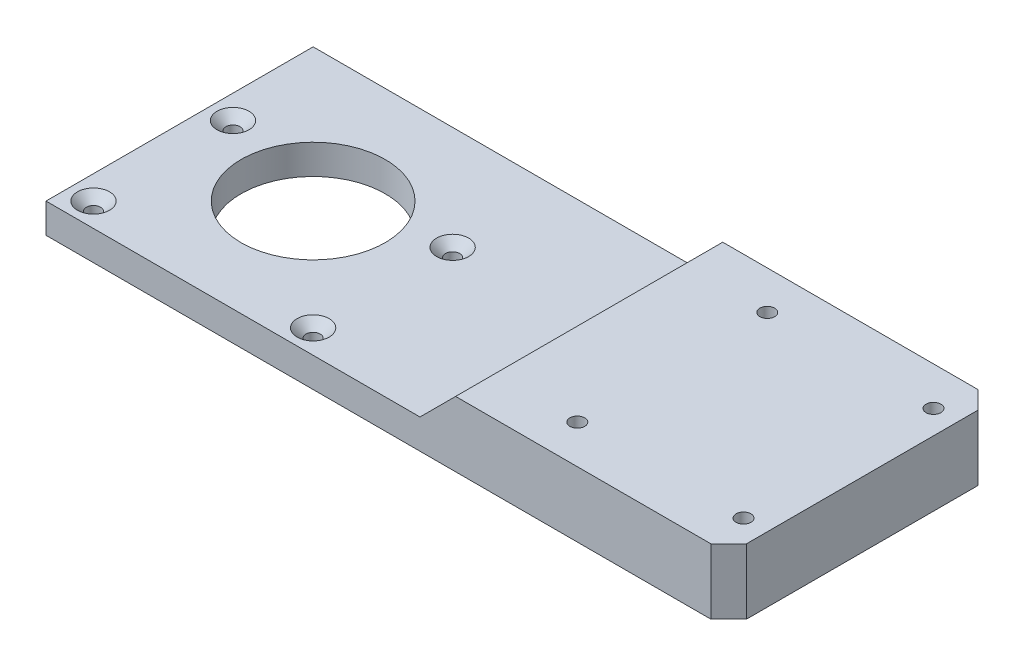
ISO-10303-21;
HEADER;
FILE_DESCRIPTION(('STEP AP214'),'2;1');
FILE_NAME('part.step','',(''),(''),'','','');
FILE_SCHEMA(('AUTOMOTIVE_DESIGN { 1 0 10303 214 1 1 1 1 }'));
ENDSEC;
DATA;
#1=APPLICATION_CONTEXT('core data for automotive mechanical design processes');
#2=APPLICATION_PROTOCOL_DEFINITION('international standard','automotive_design',2000,#1);
#3=PRODUCT_CONTEXT('',#1,'mechanical');
#4=PRODUCT('Part','Part','',(#3));
#5=PRODUCT_RELATED_PRODUCT_CATEGORY('part','',(#4));
#6=PRODUCT_DEFINITION_FORMATION('','',#4);
#7=PRODUCT_DEFINITION_CONTEXT('part definition',#1,'design');
#8=PRODUCT_DEFINITION('design','',#6,#7);
#9=PRODUCT_DEFINITION_SHAPE('','',#8);
#10=(LENGTH_UNIT() NAMED_UNIT(*) SI_UNIT(.MILLI.,.METRE.));
#11=(NAMED_UNIT(*) PLANE_ANGLE_UNIT() SI_UNIT($,.RADIAN.));
#12=(NAMED_UNIT(*) SI_UNIT($,.STERADIAN.) SOLID_ANGLE_UNIT());
#13=UNCERTAINTY_MEASURE_WITH_UNIT(LENGTH_MEASURE(1.E-05),#10,'distance_accuracy_value','');
#14=(GEOMETRIC_REPRESENTATION_CONTEXT(3) GLOBAL_UNCERTAINTY_ASSIGNED_CONTEXT((#13)) GLOBAL_UNIT_ASSIGNED_CONTEXT((#10,
#11,#12)) REPRESENTATION_CONTEXT('',''));
#15=CARTESIAN_POINT('',(0.,0.,0.));
#16=DIRECTION('',(0.,0.,1.));
#17=DIRECTION('',(1.,0.,0.));
#18=AXIS2_PLACEMENT_3D('',#15,#16,#17);
#19=CARTESIAN_POINT('',(0.,11.,0.));
#20=DIRECTION('',(0.,-1.,0.));
#21=DIRECTION('',(0.,0.,-1.));
#22=AXIS2_PLACEMENT_3D('',#19,#20,#21);
#23=PLANE('',#22);
#24=CARTESIAN_POINT('',(83.,11.,-16.));
#25=DIRECTION('',(0.,1.,0.));
#26=DIRECTION('',(0.,0.,1.));
#27=AXIS2_PLACEMENT_3D('',#24,#25,#26);
#28=CIRCLE('',#27,1.24999999999999);
#29=CARTESIAN_POINT('',(83.,11.,-14.75));
#30=VERTEX_POINT('',#29);
#31=EDGE_CURVE('E357',#30,#30,#28,.T.);
#32=ORIENTED_EDGE('',*,*,#31,.F.);
#33=EDGE_LOOP('',(#32));
#34=FACE_BOUND('',#33,.T.);
#35=CARTESIAN_POINT('',(111.,11.,-16.));
#36=DIRECTION('',(0.,1.,0.));
#37=DIRECTION('',(0.,0.,1.));
#38=AXIS2_PLACEMENT_3D('',#35,#36,#37);
#39=CIRCLE('',#38,1.24999999999999);
#40=CARTESIAN_POINT('',(111.,11.,-14.75));
#41=VERTEX_POINT('',#40);
#42=EDGE_CURVE('E353',#41,#41,#39,.T.);
#43=ORIENTED_EDGE('',*,*,#42,.F.);
#44=EDGE_LOOP('',(#43));
#45=FACE_BOUND('',#44,.T.);
#46=CARTESIAN_POINT('',(83.,11.,16.));
#47=DIRECTION('',(0.,1.,0.));
#48=DIRECTION('',(0.,0.,1.));
#49=AXIS2_PLACEMENT_3D('',#46,#47,#48);
#50=CIRCLE('',#49,1.24999999999999);
#51=CARTESIAN_POINT('',(83.,11.,17.25));
#52=VERTEX_POINT('',#51);
#53=EDGE_CURVE('E347',#52,#52,#50,.T.);
#54=ORIENTED_EDGE('',*,*,#53,.F.);
#55=EDGE_LOOP('',(#54));
#56=FACE_BOUND('',#55,.T.);
#57=DIRECTION('',(0.,0.,-1.));
#58=VECTOR('',#57,1.);
#59=CARTESIAN_POINT('',(115.,11.,-22.5));
#60=LINE('',#59,#58);
#61=CARTESIAN_POINT('',(115.,11.,19.5));
#62=VERTEX_POINT('',#61);
#63=CARTESIAN_POINT('',(115.,11.,-19.5));
#64=VERTEX_POINT('',#63);
#65=EDGE_CURVE('E131',#62,#64,#60,.T.);
#66=ORIENTED_EDGE('',*,*,#65,.T.);
#67=DIRECTION('',(-0.707106781186546,0.,-0.707106781186549));
#68=VECTOR('',#67,1.);
#69=CARTESIAN_POINT('',(112.,11.,-22.5));
#70=LINE('',#69,#68);
#71=CARTESIAN_POINT('',(112.,11.,-22.5));
#72=VERTEX_POINT('',#71);
#73=EDGE_CURVE('E47',#64,#72,#70,.T.);
#74=ORIENTED_EDGE('',*,*,#73,.T.);
#75=DIRECTION('',(-1.,0.,0.));
#76=VECTOR('',#75,1.);
#77=CARTESIAN_POINT('',(115.,11.,-22.5));
#78=LINE('',#77,#76);
#79=CARTESIAN_POINT('',(69.,11.,-22.5));
#80=VERTEX_POINT('',#79);
#81=EDGE_CURVE('E134',#72,#80,#78,.T.);
#82=ORIENTED_EDGE('',*,*,#81,.T.);
#83=DIRECTION('',(0.,0.,1.));
#84=VECTOR('',#83,1.);
#85=CARTESIAN_POINT('',(69.,11.,0.));
#86=LINE('',#85,#84);
#87=CARTESIAN_POINT('',(69.,11.,22.5));
#88=VERTEX_POINT('',#87);
#89=EDGE_CURVE('E115',#80,#88,#86,.T.);
#90=ORIENTED_EDGE('',*,*,#89,.T.);
#91=DIRECTION('',(1.,0.,0.));
#92=VECTOR('',#91,1.);
#93=CARTESIAN_POINT('',(115.,11.,22.5));
#94=LINE('',#93,#92);
#95=CARTESIAN_POINT('',(112.,11.,22.5));
#96=VERTEX_POINT('',#95);
#97=EDGE_CURVE('E109',#88,#96,#94,.T.);
#98=ORIENTED_EDGE('',*,*,#97,.T.);
#99=DIRECTION('',(-0.707106781186549,0.,0.707106781186546));
#100=VECTOR('',#99,1.);
#101=CARTESIAN_POINT('',(115.,11.,19.5));
#102=LINE('',#101,#100);
#103=EDGE_CURVE('E212',#96,#62,#102,.F.);
#104=ORIENTED_EDGE('',*,*,#103,.T.);
#105=EDGE_LOOP('',(#66,#74,#82,#90,#98,#104));
#106=FACE_BOUND('',#105,.T.);
#107=CARTESIAN_POINT('',(111.,11.,16.));
#108=DIRECTION('',(0.,1.,0.));
#109=DIRECTION('',(0.,0.,1.));
#110=AXIS2_PLACEMENT_3D('',#107,#108,#109);
#111=CIRCLE('',#110,1.24999999999999);
#112=CARTESIAN_POINT('',(111.,11.,17.25));
#113=VERTEX_POINT('',#112);
#114=EDGE_CURVE('E137',#113,#113,#111,.T.);
#115=ORIENTED_EDGE('',*,*,#114,.F.);
#116=EDGE_LOOP('',(#115));
#117=FACE_BOUND('',#116,.T.);
#118=ADVANCED_FACE('F39',(#34,#45,#56,#106,#117),#23,.F.);
#119=CARTESIAN_POINT('',(0.,5.,22.5));
#120=DIRECTION('',(0.,0.,-1.));
#121=DIRECTION('',(-1.,0.,0.));
#122=AXIS2_PLACEMENT_3D('',#119,#120,#121);
#123=PLANE('',#122);
#124=DIRECTION('',(1.,0.,0.));
#125=VECTOR('',#124,1.);
#126=CARTESIAN_POINT('',(0.,0.,22.5));
#127=LINE('',#126,#125);
#128=CARTESIAN_POINT('',(0.,0.,22.5));
#129=VERTEX_POINT('',#128);
#130=CARTESIAN_POINT('',(112.,0.,22.5));
#131=VERTEX_POINT('',#130);
#132=EDGE_CURVE('E183',#129,#131,#127,.T.);
#133=ORIENTED_EDGE('',*,*,#132,.T.);
#134=DIRECTION('',(0.,1.,0.));
#135=VECTOR('',#134,1.);
#136=CARTESIAN_POINT('',(112.,5.,22.5));
#137=LINE('',#136,#135);
#138=EDGE_CURVE('E11',#131,#96,#137,.T.);
#139=ORIENTED_EDGE('',*,*,#138,.T.);
#140=ORIENTED_EDGE('',*,*,#97,.F.);
#141=DIRECTION('',(0.707106781186546,0.707106781186549,0.));
#142=VECTOR('',#141,1.);
#143=CARTESIAN_POINT('',(69.,11.,22.5));
#144=LINE('',#143,#142);
#145=CARTESIAN_POINT('',(63.,5.,22.5));
#146=VERTEX_POINT('',#145);
#147=EDGE_CURVE('E104',#88,#146,#144,.F.);
#148=ORIENTED_EDGE('',*,*,#147,.T.);
#149=DIRECTION('',(1.,0.,0.));
#150=VECTOR('',#149,1.);
#151=CARTESIAN_POINT('',(0.,5.,22.5));
#152=LINE('',#151,#150);
#153=CARTESIAN_POINT('',(0.,5.,22.5));
#154=VERTEX_POINT('',#153);
#155=EDGE_CURVE('E107',#154,#146,#152,.T.);
#156=ORIENTED_EDGE('',*,*,#155,.F.);
#157=DIRECTION('',(0.,-1.,0.));
#158=VECTOR('',#157,1.);
#159=CARTESIAN_POINT('',(0.,5.,22.5));
#160=LINE('',#159,#158);
#161=EDGE_CURVE('E187',#154,#129,#160,.T.);
#162=ORIENTED_EDGE('',*,*,#161,.T.);
#163=EDGE_LOOP('',(#133,#139,#140,#148,#156,#162));
#164=FACE_BOUND('',#163,.T.);
#165=ADVANCED_FACE('F106',(#164),#123,.F.);
#166=CARTESIAN_POINT('',(115.,5.,22.5));
#167=DIRECTION('',(-1.,0.,0.));
#168=DIRECTION('',(0.,0.,1.));
#169=AXIS2_PLACEMENT_3D('',#166,#167,#168);
#170=PLANE('',#169);
#171=DIRECTION('',(0.,0.,-1.));
#172=VECTOR('',#171,1.);
#173=CARTESIAN_POINT('',(115.,0.,22.5));
#174=LINE('',#173,#172);
#175=CARTESIAN_POINT('',(115.,0.,19.5));
#176=VERTEX_POINT('',#175);
#177=CARTESIAN_POINT('',(115.,0.,-19.5));
#178=VERTEX_POINT('',#177);
#179=EDGE_CURVE('E189',#176,#178,#174,.T.);
#180=ORIENTED_EDGE('',*,*,#179,.T.);
#181=DIRECTION('',(0.,1.,0.));
#182=VECTOR('',#181,1.);
#183=CARTESIAN_POINT('',(115.,11.,-19.5));
#184=LINE('',#183,#182);
#185=EDGE_CURVE('E60',#178,#64,#184,.T.);
#186=ORIENTED_EDGE('',*,*,#185,.T.);
#187=ORIENTED_EDGE('',*,*,#65,.F.);
#188=DIRECTION('',(0.,-1.,0.));
#189=VECTOR('',#188,1.);
#190=CARTESIAN_POINT('',(115.,5.,19.5));
#191=LINE('',#190,#189);
#192=EDGE_CURVE('E208',#62,#176,#191,.T.);
#193=ORIENTED_EDGE('',*,*,#192,.T.);
#194=EDGE_LOOP('',(#180,#186,#187,#193));
#195=FACE_BOUND('',#194,.T.);
#196=ADVANCED_FACE('F226',(#195),#170,.F.);
#197=CARTESIAN_POINT('',(0.,5.,-22.5));
#198=DIRECTION('',(0.,0.,-1.));
#199=DIRECTION('',(-1.,0.,0.));
#200=AXIS2_PLACEMENT_3D('',#197,#198,#199);
#201=PLANE('',#200);
#202=ORIENTED_EDGE('',*,*,#81,.F.);
#203=DIRECTION('',(0.,-1.,0.));
#204=VECTOR('',#203,1.);
#205=CARTESIAN_POINT('',(112.,0.,-22.5));
#206=LINE('',#205,#204);
#207=CARTESIAN_POINT('',(112.,0.,-22.5));
#208=VERTEX_POINT('',#207);
#209=EDGE_CURVE('E201',#72,#208,#206,.T.);
#210=ORIENTED_EDGE('',*,*,#209,.T.);
#211=DIRECTION('',(1.,0.,0.));
#212=VECTOR('',#211,1.);
#213=CARTESIAN_POINT('',(0.,0.,-22.5));
#214=LINE('',#213,#212);
#215=CARTESIAN_POINT('',(0.,0.,-22.5));
#216=VERTEX_POINT('',#215);
#217=EDGE_CURVE('E191',#216,#208,#214,.T.);
#218=ORIENTED_EDGE('',*,*,#217,.F.);
#219=DIRECTION('',(0.,-1.,0.));
#220=VECTOR('',#219,1.);
#221=CARTESIAN_POINT('',(0.,5.,-22.5));
#222=LINE('',#221,#220);
#223=CARTESIAN_POINT('',(0.,5.,-22.5));
#224=VERTEX_POINT('',#223);
#225=EDGE_CURVE('E197',#224,#216,#222,.T.);
#226=ORIENTED_EDGE('',*,*,#225,.F.);
#227=DIRECTION('',(1.,0.,0.));
#228=VECTOR('',#227,1.);
#229=CARTESIAN_POINT('',(0.,5.,-22.5));
#230=LINE('',#229,#228);
#231=CARTESIAN_POINT('',(63.,5.,-22.5));
#232=VERTEX_POINT('',#231);
#233=EDGE_CURVE('E125',#224,#232,#230,.T.);
#234=ORIENTED_EDGE('',*,*,#233,.T.);
#235=DIRECTION('',(-0.707106781186546,-0.707106781186549,0.));
#236=VECTOR('',#235,1.);
#237=CARTESIAN_POINT('',(31.5000000000002,-26.5,-22.5));
#238=LINE('',#237,#236);
#239=EDGE_CURVE('E114',#232,#80,#238,.F.);
#240=ORIENTED_EDGE('',*,*,#239,.T.);
#241=EDGE_LOOP('',(#202,#210,#218,#226,#234,#240));
#242=FACE_BOUND('',#241,.T.);
#243=ADVANCED_FACE('F220',(#242),#201,.T.);
#244=CARTESIAN_POINT('',(0.,5.,22.5));
#245=DIRECTION('',(-1.,0.,0.));
#246=DIRECTION('',(0.,0.,1.));
#247=AXIS2_PLACEMENT_3D('',#244,#245,#246);
#248=PLANE('',#247);
#249=DIRECTION('',(0.,0.,-1.));
#250=VECTOR('',#249,1.);
#251=CARTESIAN_POINT('',(0.,0.,22.5));
#252=LINE('',#251,#250);
#253=EDGE_CURVE('E126',#129,#216,#252,.T.);
#254=ORIENTED_EDGE('',*,*,#253,.F.);
#255=ORIENTED_EDGE('',*,*,#161,.F.);
#256=DIRECTION('',(0.,0.,-1.));
#257=VECTOR('',#256,1.);
#258=CARTESIAN_POINT('',(0.,5.,22.5));
#259=LINE('',#258,#257);
#260=EDGE_CURVE('E124',#154,#224,#259,.T.);
#261=ORIENTED_EDGE('',*,*,#260,.T.);
#262=ORIENTED_EDGE('',*,*,#225,.T.);
#263=EDGE_LOOP('',(#254,#255,#261,#262));
#264=FACE_BOUND('',#263,.T.);
#265=ADVANCED_FACE('F233',(#264),#248,.T.);
#266=CARTESIAN_POINT('',(0.,5.,0.));
#267=DIRECTION('',(0.,1.,0.));
#268=DIRECTION('',(0.,0.,1.));
#269=AXIS2_PLACEMENT_3D('',#266,#267,#268);
#270=PLANE('',#269);
#271=DIRECTION('',(0.,0.,1.));
#272=VECTOR('',#271,1.);
#273=CARTESIAN_POINT('',(63.,5.,-22.5));
#274=LINE('',#273,#272);
#275=EDGE_CURVE('E121',#232,#146,#274,.T.);
#276=ORIENTED_EDGE('',*,*,#275,.F.);
#277=ORIENTED_EDGE('',*,*,#233,.F.);
#278=ORIENTED_EDGE('',*,*,#260,.F.);
#279=ORIENTED_EDGE('',*,*,#155,.T.);
#280=EDGE_LOOP('',(#276,#277,#278,#279));
#281=FACE_BOUND('',#280,.T.);
#282=CARTESIAN_POINT('',(4.,5.,18.5));
#283=DIRECTION('',(0.,1.,0.));
#284=DIRECTION('',(0.,0.,1.));
#285=AXIS2_PLACEMENT_3D('',#282,#283,#284);
#286=CIRCLE('',#285,2.7);
#287=CARTESIAN_POINT('',(4.,5.,21.2));
#288=VERTEX_POINT('',#287);
#289=EDGE_CURVE('E142',#288,#288,#286,.T.);
#290=ORIENTED_EDGE('',*,*,#289,.F.);
#291=EDGE_LOOP('',(#290));
#292=FACE_BOUND('',#291,.T.);
#293=CARTESIAN_POINT('',(41.,5.,18.5));
#294=DIRECTION('',(0.,1.,0.));
#295=DIRECTION('',(0.,0.,1.));
#296=AXIS2_PLACEMENT_3D('',#293,#294,#295);
#297=CIRCLE('',#296,2.7);
#298=CARTESIAN_POINT('',(41.,5.,21.2));
#299=VERTEX_POINT('',#298);
#300=EDGE_CURVE('E151',#299,#299,#297,.T.);
#301=ORIENTED_EDGE('',*,*,#300,.F.);
#302=EDGE_LOOP('',(#301));
#303=FACE_BOUND('',#302,.T.);
#304=CARTESIAN_POINT('',(41.,5.,-5.));
#305=DIRECTION('',(0.,1.,0.));
#306=DIRECTION('',(0.,0.,1.));
#307=AXIS2_PLACEMENT_3D('',#304,#305,#306);
#308=CIRCLE('',#307,2.7);
#309=CARTESIAN_POINT('',(41.,5.,-2.3));
#310=VERTEX_POINT('',#309);
#311=EDGE_CURVE('E160',#310,#310,#308,.T.);
#312=ORIENTED_EDGE('',*,*,#311,.F.);
#313=EDGE_LOOP('',(#312));
#314=FACE_BOUND('',#313,.T.);
#315=CARTESIAN_POINT('',(4.,5.,-5.));
#316=DIRECTION('',(0.,1.,0.));
#317=DIRECTION('',(0.,0.,1.));
#318=AXIS2_PLACEMENT_3D('',#315,#316,#317);
#319=CIRCLE('',#318,2.7);
#320=CARTESIAN_POINT('',(4.,5.,-2.3));
#321=VERTEX_POINT('',#320);
#322=EDGE_CURVE('E169',#321,#321,#319,.T.);
#323=ORIENTED_EDGE('',*,*,#322,.F.);
#324=EDGE_LOOP('',(#323));
#325=FACE_BOUND('',#324,.T.);
#326=CARTESIAN_POINT('',(22.5,5.,0.));
#327=DIRECTION('',(0.,1.,0.));
#328=DIRECTION('',(0.,0.,1.));
#329=AXIS2_PLACEMENT_3D('',#326,#327,#328);
#330=CIRCLE('',#329,12.142);
#331=CARTESIAN_POINT('',(22.5,5.,12.142));
#332=VERTEX_POINT('',#331);
#333=EDGE_CURVE('E178',#332,#332,#330,.T.);
#334=ORIENTED_EDGE('',*,*,#333,.F.);
#335=EDGE_LOOP('',(#334));
#336=FACE_BOUND('',#335,.T.);
#337=ADVANCED_FACE('F118',(#281,#292,#303,#314,#325,#336),#270,.T.);
#338=CARTESIAN_POINT('',(0.,0.,0.));
#339=DIRECTION('',(0.,1.,0.));
#340=DIRECTION('',(0.,0.,1.));
#341=AXIS2_PLACEMENT_3D('',#338,#339,#340);
#342=PLANE('',#341);
#343=CARTESIAN_POINT('',(83.,0.,-16.));
#344=DIRECTION('',(0.,1.,0.));
#345=DIRECTION('',(0.,0.,1.));
#346=AXIS2_PLACEMENT_3D('',#343,#344,#345);
#347=CIRCLE('',#346,1.25);
#348=CARTESIAN_POINT('',(83.,0.,-14.75));
#349=VERTEX_POINT('',#348);
#350=EDGE_CURVE('E298',#349,#349,#347,.T.);
#351=ORIENTED_EDGE('',*,*,#350,.T.);
#352=EDGE_LOOP('',(#351));
#353=FACE_BOUND('',#352,.T.);
#354=CARTESIAN_POINT('',(111.,0.,-16.));
#355=DIRECTION('',(0.,1.,0.));
#356=DIRECTION('',(0.,0.,1.));
#357=AXIS2_PLACEMENT_3D('',#354,#355,#356);
#358=CIRCLE('',#357,1.25);
#359=CARTESIAN_POINT('',(111.,0.,-14.75));
#360=VERTEX_POINT('',#359);
#361=EDGE_CURVE('E302',#360,#360,#358,.T.);
#362=ORIENTED_EDGE('',*,*,#361,.T.);
#363=EDGE_LOOP('',(#362));
#364=FACE_BOUND('',#363,.T.);
#365=CARTESIAN_POINT('',(83.,0.,16.));
#366=DIRECTION('',(0.,1.,0.));
#367=DIRECTION('',(0.,0.,1.));
#368=AXIS2_PLACEMENT_3D('',#365,#366,#367);
#369=CIRCLE('',#368,1.25);
#370=CARTESIAN_POINT('',(83.,0.,17.25));
#371=VERTEX_POINT('',#370);
#372=EDGE_CURVE('E306',#371,#371,#369,.T.);
#373=ORIENTED_EDGE('',*,*,#372,.T.);
#374=EDGE_LOOP('',(#373));
#375=FACE_BOUND('',#374,.T.);
#376=CARTESIAN_POINT('',(111.,0.,16.));
#377=DIRECTION('',(0.,1.,0.));
#378=DIRECTION('',(0.,0.,1.));
#379=AXIS2_PLACEMENT_3D('',#376,#377,#378);
#380=CIRCLE('',#379,1.25);
#381=CARTESIAN_POINT('',(111.,0.,17.25));
#382=VERTEX_POINT('',#381);
#383=EDGE_CURVE('E132',#382,#382,#380,.T.);
#384=ORIENTED_EDGE('',*,*,#383,.T.);
#385=EDGE_LOOP('',(#384));
#386=FACE_BOUND('',#385,.T.);
#387=CARTESIAN_POINT('',(4.,0.,18.5));
#388=DIRECTION('',(0.,1.,0.));
#389=DIRECTION('',(0.,0.,1.));
#390=AXIS2_PLACEMENT_3D('',#387,#388,#389);
#391=CIRCLE('',#390,1.19999999999999);
#392=CARTESIAN_POINT('',(4.,0.,19.7));
#393=VERTEX_POINT('',#392);
#394=EDGE_CURVE('E148',#393,#393,#391,.T.);
#395=ORIENTED_EDGE('',*,*,#394,.T.);
#396=EDGE_LOOP('',(#395));
#397=FACE_BOUND('',#396,.T.);
#398=CARTESIAN_POINT('',(41.,0.,18.5));
#399=DIRECTION('',(0.,1.,0.));
#400=DIRECTION('',(0.,0.,1.));
#401=AXIS2_PLACEMENT_3D('',#398,#399,#400);
#402=CIRCLE('',#401,1.19999999999999);
#403=CARTESIAN_POINT('',(41.,0.,19.7));
#404=VERTEX_POINT('',#403);
#405=EDGE_CURVE('E157',#404,#404,#402,.T.);
#406=ORIENTED_EDGE('',*,*,#405,.T.);
#407=EDGE_LOOP('',(#406));
#408=FACE_BOUND('',#407,.T.);
#409=CARTESIAN_POINT('',(41.,0.,-5.));
#410=DIRECTION('',(0.,1.,0.));
#411=DIRECTION('',(0.,0.,1.));
#412=AXIS2_PLACEMENT_3D('',#409,#410,#411);
#413=CIRCLE('',#412,1.19999999999999);
#414=CARTESIAN_POINT('',(41.,0.,-3.80000000000002));
#415=VERTEX_POINT('',#414);
#416=EDGE_CURVE('E166',#415,#415,#413,.T.);
#417=ORIENTED_EDGE('',*,*,#416,.T.);
#418=EDGE_LOOP('',(#417));
#419=FACE_BOUND('',#418,.T.);
#420=CARTESIAN_POINT('',(4.,0.,-5.));
#421=DIRECTION('',(0.,1.,0.));
#422=DIRECTION('',(0.,0.,1.));
#423=AXIS2_PLACEMENT_3D('',#420,#421,#422);
#424=CIRCLE('',#423,1.19999999999999);
#425=CARTESIAN_POINT('',(4.,0.,-3.80000000000001));
#426=VERTEX_POINT('',#425);
#427=EDGE_CURVE('E175',#426,#426,#424,.T.);
#428=ORIENTED_EDGE('',*,*,#427,.T.);
#429=EDGE_LOOP('',(#428));
#430=FACE_BOUND('',#429,.T.);
#431=CARTESIAN_POINT('',(22.5,0.,0.));
#432=DIRECTION('',(0.,1.,0.));
#433=DIRECTION('',(0.,0.,1.));
#434=AXIS2_PLACEMENT_3D('',#431,#432,#433);
#435=CIRCLE('',#434,12.142);
#436=CARTESIAN_POINT('',(22.5,0.,12.142));
#437=VERTEX_POINT('',#436);
#438=EDGE_CURVE('E181',#437,#437,#435,.F.);
#439=ORIENTED_EDGE('',*,*,#438,.F.);
#440=EDGE_LOOP('',(#439));
#441=FACE_BOUND('',#440,.T.);
#442=ORIENTED_EDGE('',*,*,#217,.T.);
#443=DIRECTION('',(0.707106781186546,0.,0.707106781186549));
#444=VECTOR('',#443,1.);
#445=CARTESIAN_POINT('',(112.,0.,-22.5));
#446=LINE('',#445,#444);
#447=EDGE_CURVE('E206',#208,#178,#446,.T.);
#448=ORIENTED_EDGE('',*,*,#447,.T.);
#449=ORIENTED_EDGE('',*,*,#179,.F.);
#450=DIRECTION('',(0.707106781186549,0.,-0.707106781186546));
#451=VECTOR('',#450,1.);
#452=CARTESIAN_POINT('',(115.,0.,19.5));
#453=LINE('',#452,#451);
#454=EDGE_CURVE('E204',#176,#131,#453,.F.);
#455=ORIENTED_EDGE('',*,*,#454,.T.);
#456=ORIENTED_EDGE('',*,*,#132,.F.);
#457=ORIENTED_EDGE('',*,*,#253,.T.);
#458=EDGE_LOOP('',(#442,#448,#449,#455,#456,#457));
#459=FACE_BOUND('',#458,.T.);
#460=ADVANCED_FACE('F225',(#353,#364,#375,#386,#397,#408,#419,#430,#441,#459),#342,.F.);
#461=CARTESIAN_POINT('',(22.5,-0.00100000000000013,0.));
#462=DIRECTION('',(0.,1.,0.));
#463=DIRECTION('',(0.,0.,1.));
#464=AXIS2_PLACEMENT_3D('',#461,#462,#463);
#465=CYLINDRICAL_SURFACE('',#464,12.142);
#466=ORIENTED_EDGE('',*,*,#333,.T.);
#467=EDGE_LOOP('',(#466));
#468=FACE_BOUND('',#467,.T.);
#469=ORIENTED_EDGE('',*,*,#438,.T.);
#470=EDGE_LOOP('',(#469));
#471=FACE_BOUND('',#470,.T.);
#472=ADVANCED_FACE('F287',(#468,#471),#465,.F.);
#473=CARTESIAN_POINT('',(4.,5.,-5.));
#474=DIRECTION('',(0.,1.,0.));
#475=DIRECTION('',(0.,0.,1.));
#476=AXIS2_PLACEMENT_3D('',#473,#474,#475);
#477=CYLINDRICAL_SURFACE('',#476,1.19999999999999);
#478=ORIENTED_EDGE('',*,*,#427,.F.);
#479=EDGE_LOOP('',(#478));
#480=FACE_BOUND('',#479,.T.);
#481=CARTESIAN_POINT('',(4.,3.5,-5.));
#482=DIRECTION('',(0.,1.,0.));
#483=DIRECTION('',(0.,0.,1.));
#484=AXIS2_PLACEMENT_3D('',#481,#482,#483);
#485=CIRCLE('',#484,1.2);
#486=CARTESIAN_POINT('',(4.,3.5,-3.8));
#487=VERTEX_POINT('',#486);
#488=EDGE_CURVE('E172',#487,#487,#485,.T.);
#489=ORIENTED_EDGE('',*,*,#488,.T.);
#490=EDGE_LOOP('',(#489));
#491=FACE_BOUND('',#490,.T.);
#492=ADVANCED_FACE('F283',(#480,#491),#477,.F.);
#493=CARTESIAN_POINT('',(4.,5.,-5.));
#494=DIRECTION('',(0.,1.,0.));
#495=DIRECTION('',(0.,0.,1.));
#496=AXIS2_PLACEMENT_3D('',#493,#494,#495);
#497=CONICAL_SURFACE('',#496,2.7,0.785398163397448);
#498=ORIENTED_EDGE('',*,*,#488,.F.);
#499=EDGE_LOOP('',(#498));
#500=FACE_BOUND('',#499,.T.);
#501=ORIENTED_EDGE('',*,*,#322,.T.);
#502=EDGE_LOOP('',(#501));
#503=FACE_BOUND('',#502,.T.);
#504=ADVANCED_FACE('F279',(#500,#503),#497,.F.);
#505=CARTESIAN_POINT('',(41.,5.,-5.));
#506=DIRECTION('',(0.,1.,0.));
#507=DIRECTION('',(0.,0.,1.));
#508=AXIS2_PLACEMENT_3D('',#505,#506,#507);
#509=CYLINDRICAL_SURFACE('',#508,1.19999999999999);
#510=ORIENTED_EDGE('',*,*,#416,.F.);
#511=EDGE_LOOP('',(#510));
#512=FACE_BOUND('',#511,.T.);
#513=CARTESIAN_POINT('',(41.,3.5,-5.));
#514=DIRECTION('',(0.,1.,0.));
#515=DIRECTION('',(0.,0.,1.));
#516=AXIS2_PLACEMENT_3D('',#513,#514,#515);
#517=CIRCLE('',#516,1.2);
#518=CARTESIAN_POINT('',(41.,3.5,-3.8));
#519=VERTEX_POINT('',#518);
#520=EDGE_CURVE('E163',#519,#519,#517,.T.);
#521=ORIENTED_EDGE('',*,*,#520,.T.);
#522=EDGE_LOOP('',(#521));
#523=FACE_BOUND('',#522,.T.);
#524=ADVANCED_FACE('F275',(#512,#523),#509,.F.);
#525=CARTESIAN_POINT('',(41.,5.,-5.));
#526=DIRECTION('',(0.,1.,0.));
#527=DIRECTION('',(0.,0.,1.));
#528=AXIS2_PLACEMENT_3D('',#525,#526,#527);
#529=CONICAL_SURFACE('',#528,2.7,0.785398163397448);
#530=ORIENTED_EDGE('',*,*,#520,.F.);
#531=EDGE_LOOP('',(#530));
#532=FACE_BOUND('',#531,.T.);
#533=ORIENTED_EDGE('',*,*,#311,.T.);
#534=EDGE_LOOP('',(#533));
#535=FACE_BOUND('',#534,.T.);
#536=ADVANCED_FACE('F271',(#532,#535),#529,.F.);
#537=CARTESIAN_POINT('',(41.,5.,18.5));
#538=DIRECTION('',(0.,1.,0.));
#539=DIRECTION('',(0.,0.,1.));
#540=AXIS2_PLACEMENT_3D('',#537,#538,#539);
#541=CYLINDRICAL_SURFACE('',#540,1.19999999999999);
#542=ORIENTED_EDGE('',*,*,#405,.F.);
#543=EDGE_LOOP('',(#542));
#544=FACE_BOUND('',#543,.T.);
#545=CARTESIAN_POINT('',(41.,3.5,18.5));
#546=DIRECTION('',(0.,1.,0.));
#547=DIRECTION('',(0.,0.,1.));
#548=AXIS2_PLACEMENT_3D('',#545,#546,#547);
#549=CIRCLE('',#548,1.2);
#550=CARTESIAN_POINT('',(41.,3.5,19.7));
#551=VERTEX_POINT('',#550);
#552=EDGE_CURVE('E154',#551,#551,#549,.T.);
#553=ORIENTED_EDGE('',*,*,#552,.T.);
#554=EDGE_LOOP('',(#553));
#555=FACE_BOUND('',#554,.T.);
#556=ADVANCED_FACE('F267',(#544,#555),#541,.F.);
#557=CARTESIAN_POINT('',(41.,5.,18.5));
#558=DIRECTION('',(0.,1.,0.));
#559=DIRECTION('',(0.,0.,1.));
#560=AXIS2_PLACEMENT_3D('',#557,#558,#559);
#561=CONICAL_SURFACE('',#560,2.7,0.785398163397448);
#562=ORIENTED_EDGE('',*,*,#552,.F.);
#563=EDGE_LOOP('',(#562));
#564=FACE_BOUND('',#563,.T.);
#565=ORIENTED_EDGE('',*,*,#300,.T.);
#566=EDGE_LOOP('',(#565));
#567=FACE_BOUND('',#566,.T.);
#568=ADVANCED_FACE('F263',(#564,#567),#561,.F.);
#569=CARTESIAN_POINT('',(4.,5.,18.5));
#570=DIRECTION('',(0.,1.,0.));
#571=DIRECTION('',(0.,0.,1.));
#572=AXIS2_PLACEMENT_3D('',#569,#570,#571);
#573=CYLINDRICAL_SURFACE('',#572,1.19999999999999);
#574=ORIENTED_EDGE('',*,*,#394,.F.);
#575=EDGE_LOOP('',(#574));
#576=FACE_BOUND('',#575,.T.);
#577=CARTESIAN_POINT('',(4.,3.5,18.5));
#578=DIRECTION('',(0.,1.,0.));
#579=DIRECTION('',(0.,0.,1.));
#580=AXIS2_PLACEMENT_3D('',#577,#578,#579);
#581=CIRCLE('',#580,1.2);
#582=CARTESIAN_POINT('',(4.,3.5,19.7));
#583=VERTEX_POINT('',#582);
#584=EDGE_CURVE('E145',#583,#583,#581,.T.);
#585=ORIENTED_EDGE('',*,*,#584,.T.);
#586=EDGE_LOOP('',(#585));
#587=FACE_BOUND('',#586,.T.);
#588=ADVANCED_FACE('F259',(#576,#587),#573,.F.);
#589=CARTESIAN_POINT('',(4.,5.,18.5));
#590=DIRECTION('',(0.,1.,0.));
#591=DIRECTION('',(0.,0.,1.));
#592=AXIS2_PLACEMENT_3D('',#589,#590,#591);
#593=CONICAL_SURFACE('',#592,2.7,0.785398163397448);
#594=ORIENTED_EDGE('',*,*,#584,.F.);
#595=EDGE_LOOP('',(#594));
#596=FACE_BOUND('',#595,.T.);
#597=ORIENTED_EDGE('',*,*,#289,.T.);
#598=EDGE_LOOP('',(#597));
#599=FACE_BOUND('',#598,.T.);
#600=ADVANCED_FACE('F256',(#596,#599),#593,.F.);
#601=CARTESIAN_POINT('',(69.,11.,0.));
#602=DIRECTION('',(0.707106781186549,-0.707106781186546,0.));
#603=DIRECTION('',(0.,0.,1.));
#604=AXIS2_PLACEMENT_3D('',#601,#602,#603);
#605=PLANE('',#604);
#606=ORIENTED_EDGE('',*,*,#239,.F.);
#607=ORIENTED_EDGE('',*,*,#275,.T.);
#608=ORIENTED_EDGE('',*,*,#147,.F.);
#609=ORIENTED_EDGE('',*,*,#89,.F.);
#610=EDGE_LOOP('',(#606,#607,#608,#609));
#611=FACE_BOUND('',#610,.T.);
#612=ADVANCED_FACE('F129',(#611),#605,.F.);
#613=CARTESIAN_POINT('',(111.,11.,16.));
#614=DIRECTION('',(0.,1.,0.));
#615=DIRECTION('',(0.,0.,1.));
#616=AXIS2_PLACEMENT_3D('',#613,#614,#615);
#617=CYLINDRICAL_SURFACE('',#616,1.24999999999999);
#618=ORIENTED_EDGE('',*,*,#383,.F.);
#619=EDGE_LOOP('',(#618));
#620=FACE_BOUND('',#619,.T.);
#621=ORIENTED_EDGE('',*,*,#114,.T.);
#622=EDGE_LOOP('',(#621));
#623=FACE_BOUND('',#622,.T.);
#624=ADVANCED_FACE('F254',(#620,#623),#617,.F.);
#625=CARTESIAN_POINT('',(83.,11.,16.));
#626=DIRECTION('',(0.,1.,0.));
#627=DIRECTION('',(0.,0.,1.));
#628=AXIS2_PLACEMENT_3D('',#625,#626,#627);
#629=CYLINDRICAL_SURFACE('',#628,1.24999999999999);
#630=ORIENTED_EDGE('',*,*,#372,.F.);
#631=EDGE_LOOP('',(#630));
#632=FACE_BOUND('',#631,.T.);
#633=ORIENTED_EDGE('',*,*,#53,.T.);
#634=EDGE_LOOP('',(#633));
#635=FACE_BOUND('',#634,.T.);
#636=ADVANCED_FACE('F343',(#632,#635),#629,.F.);
#637=CARTESIAN_POINT('',(111.,11.,-16.));
#638=DIRECTION('',(0.,1.,0.));
#639=DIRECTION('',(0.,0.,1.));
#640=AXIS2_PLACEMENT_3D('',#637,#638,#639);
#641=CYLINDRICAL_SURFACE('',#640,1.24999999999999);
#642=ORIENTED_EDGE('',*,*,#361,.F.);
#643=EDGE_LOOP('',(#642));
#644=FACE_BOUND('',#643,.T.);
#645=ORIENTED_EDGE('',*,*,#42,.T.);
#646=EDGE_LOOP('',(#645));
#647=FACE_BOUND('',#646,.T.);
#648=ADVANCED_FACE('F362',(#644,#647),#641,.F.);
#649=CARTESIAN_POINT('',(83.,11.,-16.));
#650=DIRECTION('',(0.,1.,0.));
#651=DIRECTION('',(0.,0.,1.));
#652=AXIS2_PLACEMENT_3D('',#649,#650,#651);
#653=CYLINDRICAL_SURFACE('',#652,1.24999999999999);
#654=ORIENTED_EDGE('',*,*,#350,.F.);
#655=EDGE_LOOP('',(#654));
#656=FACE_BOUND('',#655,.T.);
#657=ORIENTED_EDGE('',*,*,#31,.T.);
#658=EDGE_LOOP('',(#657));
#659=FACE_BOUND('',#658,.T.);
#660=ADVANCED_FACE('F360',(#656,#659),#653,.F.);
#661=CARTESIAN_POINT('',(112.,5.,-22.5));
#662=DIRECTION('',(0.707106781186549,0.,-0.707106781186546));
#663=DIRECTION('',(0.,1.,0.));
#664=AXIS2_PLACEMENT_3D('',#661,#662,#663);
#665=PLANE('',#664);
#666=ORIENTED_EDGE('',*,*,#73,.F.);
#667=ORIENTED_EDGE('',*,*,#185,.F.);
#668=ORIENTED_EDGE('',*,*,#447,.F.);
#669=ORIENTED_EDGE('',*,*,#209,.F.);
#670=EDGE_LOOP('',(#666,#667,#668,#669));
#671=FACE_BOUND('',#670,.T.);
#672=ADVANCED_FACE('F222',(#671),#665,.T.);
#673=CARTESIAN_POINT('',(115.,5.,19.5));
#674=DIRECTION('',(-0.707106781186546,0.,-0.707106781186549));
#675=DIRECTION('',(0.,-1.,0.));
#676=AXIS2_PLACEMENT_3D('',#673,#674,#675);
#677=PLANE('',#676);
#678=ORIENTED_EDGE('',*,*,#103,.F.);
#679=ORIENTED_EDGE('',*,*,#138,.F.);
#680=ORIENTED_EDGE('',*,*,#454,.F.);
#681=ORIENTED_EDGE('',*,*,#192,.F.);
#682=EDGE_LOOP('',(#678,#679,#680,#681));
#683=FACE_BOUND('',#682,.T.);
#684=ADVANCED_FACE('F41',(#683),#677,.F.);
#685=CLOSED_SHELL('',(#118,#165,#196,#243,#265,#337,#460,#472,#492,#504,#524,#536,#556,#568,
#588,#600,#612,#624,#636,#648,#660,#672,#684));
#686=MANIFOLD_SOLID_BREP('B2',#685);
#687=ADVANCED_BREP_SHAPE_REPRESENTATION('',(#18,#686),#14);
#688=SHAPE_DEFINITION_REPRESENTATION(#9,#687);
ENDSEC;
END-ISO-10303-21;
